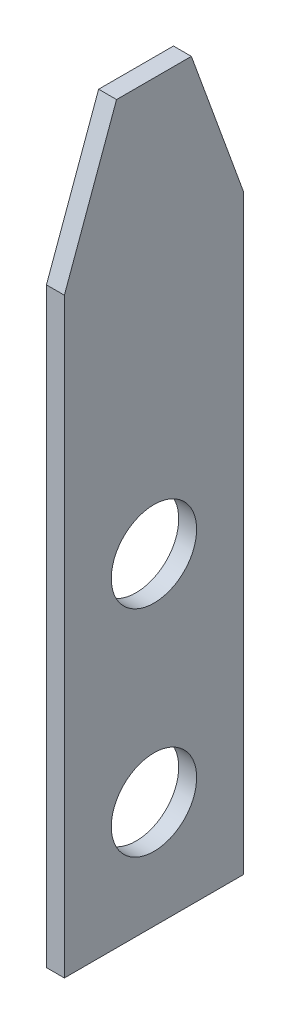
ISO-10303-21;
HEADER;
FILE_DESCRIPTION(('STEP AP214'),'2;1');
FILE_NAME('part.step','',(''),(''),'','','');
FILE_SCHEMA(('AUTOMOTIVE_DESIGN { 1 0 10303 214 1 1 1 1 }'));
ENDSEC;
DATA;
#1=APPLICATION_CONTEXT('core data for automotive mechanical design processes');
#2=APPLICATION_PROTOCOL_DEFINITION('international standard','automotive_design',2000,#1);
#3=PRODUCT_CONTEXT('',#1,'mechanical');
#4=PRODUCT('Part','Part','',(#3));
#5=PRODUCT_RELATED_PRODUCT_CATEGORY('part','',(#4));
#6=PRODUCT_DEFINITION_FORMATION('','',#4);
#7=PRODUCT_DEFINITION_CONTEXT('part definition',#1,'design');
#8=PRODUCT_DEFINITION('design','',#6,#7);
#9=PRODUCT_DEFINITION_SHAPE('','',#8);
#10=(LENGTH_UNIT() NAMED_UNIT(*) SI_UNIT(.MILLI.,.METRE.));
#11=(NAMED_UNIT(*) PLANE_ANGLE_UNIT() SI_UNIT($,.RADIAN.));
#12=(NAMED_UNIT(*) SI_UNIT($,.STERADIAN.) SOLID_ANGLE_UNIT());
#13=UNCERTAINTY_MEASURE_WITH_UNIT(LENGTH_MEASURE(1.E-05),#10,'distance_accuracy_value','');
#14=(GEOMETRIC_REPRESENTATION_CONTEXT(3) GLOBAL_UNCERTAINTY_ASSIGNED_CONTEXT((#13)) GLOBAL_UNIT_ASSIGNED_CONTEXT((#10,
#11,#12)) REPRESENTATION_CONTEXT('',''));
#15=CARTESIAN_POINT('',(0.,0.,0.));
#16=DIRECTION('',(0.,0.,1.));
#17=DIRECTION('',(1.,0.,0.));
#18=AXIS2_PLACEMENT_3D('',#15,#16,#17);
#19=CARTESIAN_POINT('',(0.5,0.,0.));
#20=DIRECTION('',(0.,0.,-1.));
#21=DIRECTION('',(-1.,0.,0.));
#22=AXIS2_PLACEMENT_3D('',#19,#20,#21);
#23=PLANE('',#22);
#24=DIRECTION('',(0.,-1.,0.));
#25=VECTOR('',#24,1.);
#26=CARTESIAN_POINT('',(0.5,0.,0.));
#27=LINE('',#26,#25);
#28=CARTESIAN_POINT('',(0.5,16.4999999999999,0.));
#29=VERTEX_POINT('',#28);
#30=CARTESIAN_POINT('',(0.5,0.,0.));
#31=VERTEX_POINT('',#30);
#32=EDGE_CURVE('E84',#29,#31,#27,.T.);
#33=ORIENTED_EDGE('',*,*,#32,.F.);
#34=DIRECTION('',(-1.,0.,0.));
#35=VECTOR('',#34,1.);
#36=CARTESIAN_POINT('',(0.5,16.5,0.));
#37=LINE('',#36,#35);
#38=CARTESIAN_POINT('',(0.,16.4999999999999,0.));
#39=VERTEX_POINT('',#38);
#40=EDGE_CURVE('E11',#29,#39,#37,.T.);
#41=ORIENTED_EDGE('',*,*,#40,.T.);
#42=DIRECTION('',(0.,-1.,0.));
#43=VECTOR('',#42,1.);
#44=CARTESIAN_POINT('',(0.,0.,0.));
#45=LINE('',#44,#43);
#46=CARTESIAN_POINT('',(0.,0.,0.));
#47=VERTEX_POINT('',#46);
#48=EDGE_CURVE('E103',#39,#47,#45,.T.);
#49=ORIENTED_EDGE('',*,*,#48,.T.);
#50=DIRECTION('',(-1.,0.,0.));
#51=VECTOR('',#50,1.);
#52=CARTESIAN_POINT('',(0.5,0.,0.));
#53=LINE('',#52,#51);
#54=EDGE_CURVE('E97',#31,#47,#53,.T.);
#55=ORIENTED_EDGE('',*,*,#54,.F.);
#56=EDGE_LOOP('',(#33,#41,#49,#55));
#57=FACE_BOUND('',#56,.T.);
#58=ADVANCED_FACE('F31',(#57),#23,.F.);
#59=CARTESIAN_POINT('',(0.5,0.,0.));
#60=DIRECTION('',(0.,1.,0.));
#61=DIRECTION('',(0.,0.,1.));
#62=AXIS2_PLACEMENT_3D('',#59,#60,#61);
#63=PLANE('',#62);
#64=DIRECTION('',(0.,0.,-1.));
#65=VECTOR('',#64,1.);
#66=CARTESIAN_POINT('',(0.,0.,0.));
#67=LINE('',#66,#65);
#68=CARTESIAN_POINT('',(0.,0.,-5.));
#69=VERTEX_POINT('',#68);
#70=EDGE_CURVE('E136',#47,#69,#67,.T.);
#71=ORIENTED_EDGE('',*,*,#70,.T.);
#72=DIRECTION('',(-1.,0.,0.));
#73=VECTOR('',#72,1.);
#74=CARTESIAN_POINT('',(0.5,0.,-5.));
#75=LINE('',#74,#73);
#76=CARTESIAN_POINT('',(0.5,0.,-5.));
#77=VERTEX_POINT('',#76);
#78=EDGE_CURVE('E99',#77,#69,#75,.T.);
#79=ORIENTED_EDGE('',*,*,#78,.F.);
#80=DIRECTION('',(0.,0.,-1.));
#81=VECTOR('',#80,1.);
#82=CARTESIAN_POINT('',(0.5,0.,0.));
#83=LINE('',#82,#81);
#84=EDGE_CURVE('E87',#31,#77,#83,.T.);
#85=ORIENTED_EDGE('',*,*,#84,.F.);
#86=ORIENTED_EDGE('',*,*,#54,.T.);
#87=EDGE_LOOP('',(#71,#79,#85,#86));
#88=FACE_BOUND('',#87,.T.);
#89=ADVANCED_FACE('F96',(#88),#63,.F.);
#90=CARTESIAN_POINT('',(0.5,0.,-5.));
#91=DIRECTION('',(0.,0.,1.));
#92=DIRECTION('',(1.,0.,0.));
#93=AXIS2_PLACEMENT_3D('',#90,#91,#92);
#94=PLANE('',#93);
#95=DIRECTION('',(0.,1.,0.));
#96=VECTOR('',#95,1.);
#97=CARTESIAN_POINT('',(0.,0.,-5.));
#98=LINE('',#97,#96);
#99=CARTESIAN_POINT('',(0.,16.5,-5.));
#100=VERTEX_POINT('',#99);
#101=EDGE_CURVE('E134',#69,#100,#98,.T.);
#102=ORIENTED_EDGE('',*,*,#101,.T.);
#103=DIRECTION('',(1.,0.,0.));
#104=VECTOR('',#103,1.);
#105=CARTESIAN_POINT('',(0.5,16.5,-5.));
#106=LINE('',#105,#104);
#107=CARTESIAN_POINT('',(0.5,16.5,-5.));
#108=VERTEX_POINT('',#107);
#109=EDGE_CURVE('E54',#100,#108,#106,.T.);
#110=ORIENTED_EDGE('',*,*,#109,.T.);
#111=DIRECTION('',(0.,1.,0.));
#112=VECTOR('',#111,1.);
#113=CARTESIAN_POINT('',(0.5,0.,-5.));
#114=LINE('',#113,#112);
#115=EDGE_CURVE('E100',#77,#108,#114,.T.);
#116=ORIENTED_EDGE('',*,*,#115,.F.);
#117=ORIENTED_EDGE('',*,*,#78,.T.);
#118=EDGE_LOOP('',(#102,#110,#116,#117));
#119=FACE_BOUND('',#118,.T.);
#120=ADVANCED_FACE('F135',(#119),#94,.F.);
#121=CARTESIAN_POINT('',(0.5,20.5,0.));
#122=DIRECTION('',(0.,-1.,0.));
#123=DIRECTION('',(0.,0.,-1.));
#124=AXIS2_PLACEMENT_3D('',#121,#122,#123);
#125=PLANE('',#124);
#126=DIRECTION('',(0.,0.,1.));
#127=VECTOR('',#126,1.);
#128=CARTESIAN_POINT('',(0.5,20.5,0.));
#129=LINE('',#128,#127);
#130=CARTESIAN_POINT('',(0.5,20.5,-3.54411906293519));
#131=VERTEX_POINT('',#130);
#132=CARTESIAN_POINT('',(0.5,20.5,-1.45588093706481));
#133=VERTEX_POINT('',#132);
#134=EDGE_CURVE('E109',#131,#133,#129,.T.);
#135=ORIENTED_EDGE('',*,*,#134,.F.);
#136=DIRECTION('',(-1.,0.,0.));
#137=VECTOR('',#136,1.);
#138=CARTESIAN_POINT('',(0.5,20.5,-3.54411906293519));
#139=LINE('',#138,#137);
#140=CARTESIAN_POINT('',(0.,20.5,-3.54411906293519));
#141=VERTEX_POINT('',#140);
#142=EDGE_CURVE('E107',#131,#141,#139,.T.);
#143=ORIENTED_EDGE('',*,*,#142,.T.);
#144=DIRECTION('',(0.,0.,1.));
#145=VECTOR('',#144,1.);
#146=CARTESIAN_POINT('',(0.,20.5,0.));
#147=LINE('',#146,#145);
#148=CARTESIAN_POINT('',(0.,20.5,-1.45588093706481));
#149=VERTEX_POINT('',#148);
#150=EDGE_CURVE('E92',#141,#149,#147,.T.);
#151=ORIENTED_EDGE('',*,*,#150,.T.);
#152=DIRECTION('',(1.,0.,0.));
#153=VECTOR('',#152,1.);
#154=CARTESIAN_POINT('',(0.5,20.5,-1.45588093706481));
#155=LINE('',#154,#153);
#156=EDGE_CURVE('E105',#149,#133,#155,.T.);
#157=ORIENTED_EDGE('',*,*,#156,.T.);
#158=EDGE_LOOP('',(#135,#143,#151,#157));
#159=FACE_BOUND('',#158,.T.);
#160=ADVANCED_FACE('F125',(#159),#125,.F.);
#161=CARTESIAN_POINT('',(0.5,20.5,0.));
#162=DIRECTION('',(-1.,0.,0.));
#163=DIRECTION('',(0.,0.,1.));
#164=AXIS2_PLACEMENT_3D('',#161,#162,#163);
#165=PLANE('',#164);
#166=CARTESIAN_POINT('',(0.5,3.,-2.5));
#167=DIRECTION('',(-1.,0.,0.));
#168=DIRECTION('',(0.,0.,1.));
#169=AXIS2_PLACEMENT_3D('',#166,#167,#168);
#170=CIRCLE('',#169,1.19126);
#171=CARTESIAN_POINT('',(0.5,3.,-1.30874));
#172=VERTEX_POINT('',#171);
#173=EDGE_CURVE('E148',#172,#172,#170,.T.);
#174=ORIENTED_EDGE('',*,*,#173,.T.);
#175=EDGE_LOOP('',(#174));
#176=FACE_BOUND('',#175,.T.);
#177=CARTESIAN_POINT('',(0.5,9.,-2.5));
#178=DIRECTION('',(-1.,0.,0.));
#179=DIRECTION('',(0.,0.,1.));
#180=AXIS2_PLACEMENT_3D('',#177,#178,#179);
#181=CIRCLE('',#180,1.19126);
#182=CARTESIAN_POINT('',(0.5,9.,-1.30874));
#183=VERTEX_POINT('',#182);
#184=EDGE_CURVE('E140',#183,#183,#181,.T.);
#185=ORIENTED_EDGE('',*,*,#184,.T.);
#186=EDGE_LOOP('',(#185));
#187=FACE_BOUND('',#186,.T.);
#188=ORIENTED_EDGE('',*,*,#115,.T.);
#189=DIRECTION('',(0.,-0.939692620785909,-0.342020143325667));
#190=VECTOR('',#189,1.);
#191=CARTESIAN_POINT('',(0.5,20.5,-3.54411906293519));
#192=LINE('',#191,#190);
#193=EDGE_CURVE('E39',#108,#131,#192,.F.);
#194=ORIENTED_EDGE('',*,*,#193,.T.);
#195=ORIENTED_EDGE('',*,*,#134,.T.);
#196=DIRECTION('',(0.,0.939692620785909,-0.342020143325667));
#197=VECTOR('',#196,1.);
#198=CARTESIAN_POINT('',(0.5,16.5,0.));
#199=LINE('',#198,#197);
#200=EDGE_CURVE('E46',#133,#29,#199,.F.);
#201=ORIENTED_EDGE('',*,*,#200,.T.);
#202=ORIENTED_EDGE('',*,*,#32,.T.);
#203=ORIENTED_EDGE('',*,*,#84,.T.);
#204=EDGE_LOOP('',(#188,#194,#195,#201,#202,#203));
#205=FACE_BOUND('',#204,.T.);
#206=ADVANCED_FACE('F86',(#176,#187,#205),#165,.F.);
#207=CARTESIAN_POINT('',(0.,20.5,0.));
#208=DIRECTION('',(-1.,0.,0.));
#209=DIRECTION('',(0.,0.,1.));
#210=AXIS2_PLACEMENT_3D('',#207,#208,#209);
#211=PLANE('',#210);
#212=CARTESIAN_POINT('',(0.,3.,-2.5));
#213=DIRECTION('',(-1.,0.,0.));
#214=DIRECTION('',(0.,0.,1.));
#215=AXIS2_PLACEMENT_3D('',#212,#213,#214);
#216=CIRCLE('',#215,1.19125999999999);
#217=CARTESIAN_POINT('',(0.,3.,-1.30874000000001));
#218=VERTEX_POINT('',#217);
#219=EDGE_CURVE('E151',#218,#218,#216,.T.);
#220=ORIENTED_EDGE('',*,*,#219,.F.);
#221=EDGE_LOOP('',(#220));
#222=FACE_BOUND('',#221,.T.);
#223=CARTESIAN_POINT('',(0.,9.,-2.5));
#224=DIRECTION('',(-1.,0.,0.));
#225=DIRECTION('',(0.,0.,1.));
#226=AXIS2_PLACEMENT_3D('',#223,#224,#225);
#227=CIRCLE('',#226,1.19125999999999);
#228=CARTESIAN_POINT('',(0.,9.,-1.30874000000001));
#229=VERTEX_POINT('',#228);
#230=EDGE_CURVE('E145',#229,#229,#227,.T.);
#231=ORIENTED_EDGE('',*,*,#230,.F.);
#232=EDGE_LOOP('',(#231));
#233=FACE_BOUND('',#232,.T.);
#234=ORIENTED_EDGE('',*,*,#150,.F.);
#235=DIRECTION('',(0.,0.939692620785909,0.342020143325667));
#236=VECTOR('',#235,1.);
#237=CARTESIAN_POINT('',(0.,21.6390579104543,-3.12953588842437));
#238=LINE('',#237,#236);
#239=EDGE_CURVE('E117',#141,#100,#238,.F.);
#240=ORIENTED_EDGE('',*,*,#239,.T.);
#241=ORIENTED_EDGE('',*,*,#101,.F.);
#242=ORIENTED_EDGE('',*,*,#70,.F.);
#243=ORIENTED_EDGE('',*,*,#48,.F.);
#244=DIRECTION('',(0.,-0.939692620785909,0.342020143325667));
#245=VECTOR('',#244,1.);
#246=CARTESIAN_POINT('',(0.,20.032088886238,-1.28557521937308));
#247=LINE('',#246,#245);
#248=EDGE_CURVE('E115',#39,#149,#247,.F.);
#249=ORIENTED_EDGE('',*,*,#248,.T.);
#250=EDGE_LOOP('',(#234,#240,#241,#242,#243,#249));
#251=FACE_BOUND('',#250,.T.);
#252=ADVANCED_FACE('F133',(#222,#233,#251),#211,.T.);
#253=CARTESIAN_POINT('',(0.,9.,-2.5));
#254=DIRECTION('',(-1.,0.,0.));
#255=DIRECTION('',(0.,0.,1.));
#256=AXIS2_PLACEMENT_3D('',#253,#254,#255);
#257=CYLINDRICAL_SURFACE('',#256,1.19125999999999);
#258=ORIENTED_EDGE('',*,*,#184,.F.);
#259=EDGE_LOOP('',(#258));
#260=FACE_BOUND('',#259,.T.);
#261=ORIENTED_EDGE('',*,*,#230,.T.);
#262=EDGE_LOOP('',(#261));
#263=FACE_BOUND('',#262,.T.);
#264=ADVANCED_FACE('F159',(#260,#263),#257,.F.);
#265=CARTESIAN_POINT('',(0.,3.,-2.5));
#266=DIRECTION('',(-1.,0.,0.));
#267=DIRECTION('',(0.,0.,1.));
#268=AXIS2_PLACEMENT_3D('',#265,#266,#267);
#269=CYLINDRICAL_SURFACE('',#268,1.19125999999999);
#270=ORIENTED_EDGE('',*,*,#173,.F.);
#271=EDGE_LOOP('',(#270));
#272=FACE_BOUND('',#271,.T.);
#273=ORIENTED_EDGE('',*,*,#219,.T.);
#274=EDGE_LOOP('',(#273));
#275=FACE_BOUND('',#274,.T.);
#276=ADVANCED_FACE('F155',(#272,#275),#269,.F.);
#277=CARTESIAN_POINT('',(0.5,20.5,-3.54411906293519));
#278=DIRECTION('',(0.,-0.342020143325667,0.939692620785909));
#279=DIRECTION('',(0.,-0.939692620785909,-0.342020143325667));
#280=AXIS2_PLACEMENT_3D('',#277,#278,#279);
#281=PLANE('',#280);
#282=ORIENTED_EDGE('',*,*,#193,.F.);
#283=ORIENTED_EDGE('',*,*,#109,.F.);
#284=ORIENTED_EDGE('',*,*,#239,.F.);
#285=ORIENTED_EDGE('',*,*,#142,.F.);
#286=EDGE_LOOP('',(#282,#283,#284,#285));
#287=FACE_BOUND('',#286,.T.);
#288=ADVANCED_FACE('F130',(#287),#281,.F.);
#289=CARTESIAN_POINT('',(0.5,16.5,0.));
#290=DIRECTION('',(0.,-0.342020143325667,-0.939692620785909));
#291=DIRECTION('',(0.,0.939692620785909,-0.342020143325667));
#292=AXIS2_PLACEMENT_3D('',#289,#290,#291);
#293=PLANE('',#292);
#294=ORIENTED_EDGE('',*,*,#200,.F.);
#295=ORIENTED_EDGE('',*,*,#156,.F.);
#296=ORIENTED_EDGE('',*,*,#248,.F.);
#297=ORIENTED_EDGE('',*,*,#40,.F.);
#298=EDGE_LOOP('',(#294,#295,#296,#297));
#299=FACE_BOUND('',#298,.T.);
#300=ADVANCED_FACE('F33',(#299),#293,.F.);
#301=CLOSED_SHELL('',(#58,#89,#120,#160,#206,#252,#264,#276,#288,#300));
#302=MANIFOLD_SOLID_BREP('B2',#301);
#303=ADVANCED_BREP_SHAPE_REPRESENTATION('',(#18,#302),#14);
#304=SHAPE_DEFINITION_REPRESENTATION(#9,#303);
ENDSEC;
END-ISO-10303-21;
